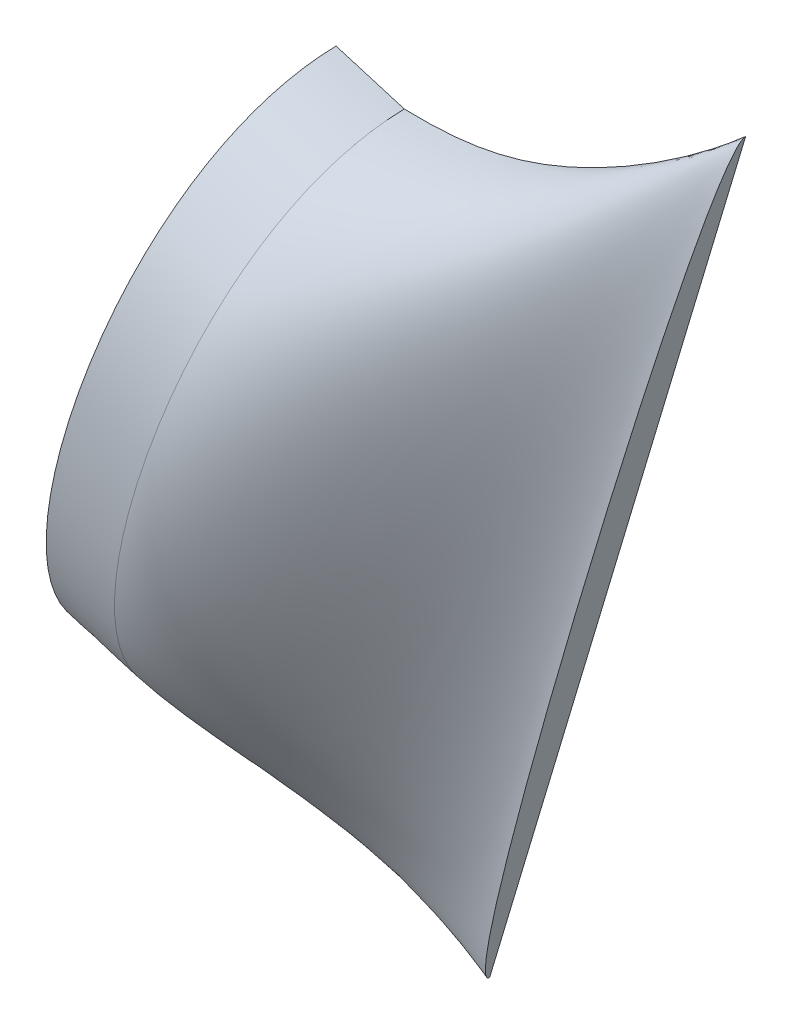
ISO-10303-21;
HEADER;
FILE_DESCRIPTION(('STEP AP214'),'2;1');
FILE_NAME('part.step','',(''),(''),'','','');
FILE_SCHEMA(('AUTOMOTIVE_DESIGN { 1 0 10303 214 1 1 1 1 }'));
ENDSEC;
DATA;
#1=APPLICATION_CONTEXT('core data for automotive mechanical design processes');
#2=APPLICATION_PROTOCOL_DEFINITION('international standard','automotive_design',2000,#1);
#3=PRODUCT_CONTEXT('',#1,'mechanical');
#4=PRODUCT('Part','Part','',(#3));
#5=PRODUCT_RELATED_PRODUCT_CATEGORY('part','',(#4));
#6=PRODUCT_DEFINITION_FORMATION('','',#4);
#7=PRODUCT_DEFINITION_CONTEXT('part definition',#1,'design');
#8=PRODUCT_DEFINITION('design','',#6,#7);
#9=PRODUCT_DEFINITION_SHAPE('','',#8);
#10=(LENGTH_UNIT() NAMED_UNIT(*) SI_UNIT(.MILLI.,.METRE.));
#11=(NAMED_UNIT(*) PLANE_ANGLE_UNIT() SI_UNIT($,.RADIAN.));
#12=(NAMED_UNIT(*) SI_UNIT($,.STERADIAN.) SOLID_ANGLE_UNIT());
#13=UNCERTAINTY_MEASURE_WITH_UNIT(LENGTH_MEASURE(1.E-05),#10,'distance_accuracy_value','');
#14=(GEOMETRIC_REPRESENTATION_CONTEXT(3) GLOBAL_UNCERTAINTY_ASSIGNED_CONTEXT((#13)) GLOBAL_UNIT_ASSIGNED_CONTEXT((#10,
#11,#12)) REPRESENTATION_CONTEXT('',''));
#15=CARTESIAN_POINT('',(0.,0.,0.));
#16=DIRECTION('',(0.,0.,1.));
#17=DIRECTION('',(1.,0.,0.));
#18=AXIS2_PLACEMENT_3D('',#15,#16,#17);
#19=CARTESIAN_POINT('',(-68.8351354727939,20.5796630643947,0.));
#20=DIRECTION('',(0.,0.,1.));
#21=DIRECTION('',(1.,0.,0.));
#22=AXIS2_PLACEMENT_3D('',#19,#20,#21);
#23=PLANE('',#22);
#24=DIRECTION('',(-0.28644268795493,-0.958097378410543,0.));
#25=VECTOR('',#24,1.);
#26=CARTESIAN_POINT('',(-75.1754818984992,-8.30803292728945,0.));
#27=LINE('',#26,#25);
#28=CARTESIAN_POINT('',(-71.680881105449,3.38075508931917,0.));
#29=VERTEX_POINT('',#28);
#30=CARTESIAN_POINT('',(-75.1754818984992,-8.30803292728945,0.));
#31=VERTEX_POINT('',#30);
#32=EDGE_CURVE('E119',#29,#31,#27,.T.);
#33=ORIENTED_EDGE('',*,*,#32,.F.);
#34=DIRECTION('',(-0.958097378410543,0.28644268795493,0.));
#35=VECTOR('',#34,1.);
#36=CARTESIAN_POINT('',(-71.680881105449,3.38075508931917,0.));
#37=LINE('',#36,#35);
#38=CARTESIAN_POINT('',(-76.6629874731838,4.87025706668481,0.));
#39=VERTEX_POINT('',#38);
#40=EDGE_CURVE('E141',#29,#39,#37,.T.);
#41=ORIENTED_EDGE('',*,*,#40,.T.);
#42=DIRECTION('',(0.28644268795493,0.958097378410543,0.));
#43=VECTOR('',#42,1.);
#44=CARTESIAN_POINT('',(-71.7094276080255,21.4389911282595,0.));
#45=LINE('',#44,#43);
#46=CARTESIAN_POINT('',(-74.8260320558074,11.0145304018182,1.41892161006732E-13));
#47=VERTEX_POINT('',#46);
#48=EDGE_CURVE('E206',#39,#47,#45,.T.);
#49=ORIENTED_EDGE('',*,*,#48,.T.);
#50=DIRECTION('',(-0.958097378410543,0.28644268795493,0.));
#51=VECTOR('',#50,1.);
#52=CARTESIAN_POINT('',(-71.9517399205758,10.1552023379534,1.43136294104055E-13));
#53=LINE('',#52,#51);
#54=CARTESIAN_POINT('',(-71.9517399205758,10.1552023379534,0.));
#55=VERTEX_POINT('',#54);
#56=EDGE_CURVE('E11',#55,#47,#53,.T.);
#57=ORIENTED_EDGE('',*,*,#56,.F.);
#58=CARTESIAN_POINT('',(-71.9517399205758,10.1552023379534,0.));
#59=CARTESIAN_POINT('',(-69.5938616061763,10.0813238258005,0.));
#60=CARTESIAN_POINT('',(-65.4570985045668,10.7673698634453,0.));
#61=CARTESIAN_POINT('',(-60.011062756017,14.2052009776582,0.));
#62=CARTESIAN_POINT('',(-57.5775416453369,16.3410180657399,0.));
#63=B_SPLINE_CURVE_WITH_KNOTS('',3,(#58,#59,#60,#61,#62),.UNSPECIFIED.,.F.,.F.,(4,1,4),(0.,
0.464218351567374,1.),.UNSPECIFIED.);
#64=CARTESIAN_POINT('',(-57.5775416453369,16.3410180657399,0.));
#65=VERTEX_POINT('',#64);
#66=EDGE_CURVE('E143',#65,#55,#63,.F.);
#67=ORIENTED_EDGE('',*,*,#66,.F.);
#68=DIRECTION('',(0.286442687954896,0.958097378410553,0.));
#69=VECTOR('',#68,1.);
#70=CARTESIAN_POINT('',(-68.3594778518222,-19.7225480436874,0.));
#71=LINE('',#70,#69);
#72=CARTESIAN_POINT('',(-68.3594778518222,-19.7225480436874,0.));
#73=VERTEX_POINT('',#72);
#74=EDGE_CURVE('E194',#73,#65,#71,.T.);
#75=ORIENTED_EDGE('',*,*,#74,.F.);
#76=CARTESIAN_POINT('',(-79.1202515483788,-13.822132348922,0.));
#77=CARTESIAN_POINT('',(-77.2430299362491,-14.4970734561594,0.));
#78=CARTESIAN_POINT('',(-73.2538280253343,-16.3282447215019,0.));
#79=CARTESIAN_POINT('',(-70.0691808052114,-18.4306839193362,0.));
#80=CARTESIAN_POINT('',(-68.3594778518222,-19.7225480436874,0.));
#81=B_SPLINE_CURVE_WITH_KNOTS('',3,(#76,#77,#78,#79,#80),.UNSPECIFIED.,.F.,.F.,(4,1,4),(0.,
0.464218351567374,1.),.UNSPECIFIED.);
#82=CARTESIAN_POINT('',(-79.1202515483788,-13.822132348922,0.));
#83=VERTEX_POINT('',#82);
#84=EDGE_CURVE('E148',#83,#73,#81,.T.);
#85=ORIENTED_EDGE('',*,*,#84,.F.);
#86=DIRECTION('',(-0.958097378410543,0.28644268795493,0.));
#87=VECTOR('',#86,1.);
#88=CARTESIAN_POINT('',(-79.1202515483788,-13.822132348922,0.));
#89=LINE('',#88,#87);
#90=CARTESIAN_POINT('',(-81.9945436836104,-12.9628042850572,0.));
#91=VERTEX_POINT('',#90);
#92=EDGE_CURVE('E47',#83,#91,#89,.T.);
#93=ORIENTED_EDGE('',*,*,#92,.T.);
#94=CARTESIAN_POINT('',(-80.157588266234,-6.81853094992381,0.));
#95=VERTEX_POINT('',#94);
#96=EDGE_CURVE('E125',#91,#95,#45,.T.);
#97=ORIENTED_EDGE('',*,*,#96,.T.);
#98=DIRECTION('',(-0.958097378410543,0.28644268795493,0.));
#99=VECTOR('',#98,1.);
#100=CARTESIAN_POINT('',(-75.1754818984992,-8.30803292728945,0.));
#101=LINE('',#100,#99);
#102=EDGE_CURVE('E112',#31,#95,#101,.T.);
#103=ORIENTED_EDGE('',*,*,#102,.F.);
#104=EDGE_LOOP('',(#33,#41,#49,#57,#67,#75,#85,#93,#97,#103));
#105=FACE_BOUND('',#104,.T.);
#106=ADVANCED_FACE('F37',(#105),#23,.F.);
#107=CARTESIAN_POINT('',(-71.9517399205757,10.1552023379534,0.));
#108=CARTESIAN_POINT('',(-72.0475401790211,9.83476833727146,10.4883470019911));
#109=CARTESIAN_POINT('',(-78.9396589990728,-13.2180839464793,10.3872504791321));
#110=CARTESIAN_POINT('',(-79.1202515483788,-13.822132348922,0.));
#111=B_SPLINE_CURVE_WITH_KNOTS('',3,(#107,#108,#109,#110),.UNSPECIFIED.,.F.,.F.,(4,4),(0.,1.),.UNSPECIFIED.);
#112=DIRECTION('',(-0.958097378410543,0.28644268795493,0.));
#113=VECTOR('',#112,1.);
#114=SURFACE_OF_LINEAR_EXTRUSION('',#111,#113);
#115=CARTESIAN_POINT('',(-74.8260320558074,11.0145304018182,0.));
#116=CARTESIAN_POINT('',(-74.9218323142527,10.6940964011362,10.4883470019911));
#117=CARTESIAN_POINT('',(-81.8139511343044,-12.3587558826145,10.3872504791321));
#118=CARTESIAN_POINT('',(-81.9945436836104,-12.9628042850572,0.));
#119=B_SPLINE_CURVE_WITH_KNOTS('',3,(#115,#116,#117,#118),.UNSPECIFIED.,.F.,.F.,(4,4),(0.,1.),.UNSPECIFIED.);
#120=EDGE_CURVE('E75',#47,#91,#119,.T.);
#121=ORIENTED_EDGE('',*,*,#120,.T.);
#122=ORIENTED_EDGE('',*,*,#92,.F.);
#123=CARTESIAN_POINT('',(-71.9517399205758,10.1552023379534,0.));
#124=CARTESIAN_POINT('',(-72.0475401790211,9.83476833727144,10.4883470019911));
#125=CARTESIAN_POINT('',(-78.9396589990728,-13.2180839464794,10.3872504791321));
#126=CARTESIAN_POINT('',(-79.1202515483788,-13.822132348922,0.));
#127=B_SPLINE_CURVE_WITH_KNOTS('',3,(#123,#124,#125,#126),.UNSPECIFIED.,.F.,.F.,(4,4),(0.,1.),.UNSPECIFIED.);
#128=EDGE_CURVE('E64',#55,#83,#127,.T.);
#129=ORIENTED_EDGE('',*,*,#128,.F.);
#130=ORIENTED_EDGE('',*,*,#56,.T.);
#131=EDGE_LOOP('',(#121,#122,#129,#130));
#132=FACE_BOUND('',#131,.T.);
#133=ADVANCED_FACE('F226',(#132),#114,.F.);
#134=CARTESIAN_POINT('',(-71.7094276080255,21.4389911282595,0.));
#135=DIRECTION('',(0.958097378410543,-0.28644268795493,0.));
#136=DIRECTION('',(-0.28644268795493,-0.958097378410543,0.));
#137=AXIS2_PLACEMENT_3D('',#134,#135,#136);
#138=PLANE('',#137);
#139=ORIENTED_EDGE('',*,*,#48,.F.);
#140=DIRECTION('',(0.,0.,-1.));
#141=VECTOR('',#140,1.);
#142=CARTESIAN_POINT('',(-76.6629874731838,4.87025706668481,0.));
#143=LINE('',#142,#141);
#144=CARTESIAN_POINT('',(-76.6629874731838,4.87025706668481,4.09999999999997));
#145=VERTEX_POINT('',#144);
#146=EDGE_CURVE('E131',#145,#39,#143,.T.);
#147=ORIENTED_EDGE('',*,*,#146,.F.);
#148=DIRECTION('',(0.28644268795493,0.958097378410543,0.));
#149=VECTOR('',#148,1.);
#150=CARTESIAN_POINT('',(-76.6629874731838,4.87025706668481,4.09999999999997));
#151=LINE('',#150,#149);
#152=CARTESIAN_POINT('',(-80.157588266234,-6.81853094992381,4.09999999999998));
#153=VERTEX_POINT('',#152);
#154=EDGE_CURVE('E133',#153,#145,#151,.T.);
#155=ORIENTED_EDGE('',*,*,#154,.F.);
#156=DIRECTION('',(0.,0.,1.));
#157=VECTOR('',#156,1.);
#158=CARTESIAN_POINT('',(-80.157588266234,-6.81853094992381,4.09999999999998));
#159=LINE('',#158,#157);
#160=EDGE_CURVE('E55',#95,#153,#159,.T.);
#161=ORIENTED_EDGE('',*,*,#160,.F.);
#162=ORIENTED_EDGE('',*,*,#96,.F.);
#163=ORIENTED_EDGE('',*,*,#120,.F.);
#164=EDGE_LOOP('',(#139,#147,#155,#161,#162,#163));
#165=FACE_BOUND('',#164,.T.);
#166=ADVANCED_FACE('F229',(#165),#138,.F.);
#167=CARTESIAN_POINT('',(-62.9685097485796,-1.69076498897374,1.27791279282259));
#168=DIRECTION('',(-0.958097378410553,0.286442687954896,0.));
#169=DIRECTION('',(0.286442687954896,0.958097378410553,0.));
#170=AXIS2_PLACEMENT_3D('',#167,#168,#169);
#171=PLANE('',#170);
#172=CARTESIAN_POINT('',(-57.5775416453369,16.3410180657399,0.));
#173=CARTESIAN_POINT('',(-57.5775416453369,16.3410180657399,1.70388372376346));
#174=CARTESIAN_POINT('',(-68.3594778518222,-19.7225480436874,1.70388372376348));
#175=CARTESIAN_POINT('',(-68.3594778518222,-19.7225480436874,0.));
#176=B_SPLINE_CURVE_WITH_KNOTS('',3,(#172,#173,#174,#175),.UNSPECIFIED.,.F.,.F.,(4,4),(0.,1.),.UNSPECIFIED.);
#177=EDGE_CURVE('E79',#65,#73,#176,.T.);
#178=ORIENTED_EDGE('',*,*,#177,.T.);
#179=ORIENTED_EDGE('',*,*,#74,.T.);
#180=EDGE_LOOP('',(#178,#179));
#181=FACE_BOUND('',#180,.T.);
#182=ADVANCED_FACE('F174',(#181),#171,.F.);
#183=CARTESIAN_POINT('',(-71.9517399205758,10.1552023379534,0.));
#184=CARTESIAN_POINT('',(-69.5938616061763,10.0813238258005,0.));
#185=CARTESIAN_POINT('',(-65.4570985045668,10.7673698634453,0.));
#186=CARTESIAN_POINT('',(-60.011062756017,14.2052009776582,0.));
#187=CARTESIAN_POINT('',(-57.5775416453369,16.3410180657399,0.));
#188=CARTESIAN_POINT('',(-72.0475401790211,9.83476833727144,10.4883470019911));
#189=CARTESIAN_POINT('',(-69.8498807653782,9.56053562675707,10.4883470019911));
#190=CARTESIAN_POINT('',(-65.4138783339914,10.5729305449382,6.19197021566485));
#191=CARTESIAN_POINT('',(-59.76979003692,15.3477613818025,1.70388372376346));
#192=CARTESIAN_POINT('',(-57.5775416453369,16.3410180657399,1.70388372376346));
#193=CARTESIAN_POINT('',(-78.9396589990728,-13.2180839464794,10.3872504791321));
#194=CARTESIAN_POINT('',(-76.9022184861865,-13.6926708553552,10.3872504791321));
#195=CARTESIAN_POINT('',(-73.3459800759381,-16.2974734173909,6.25031093128427));
#196=CARTESIAN_POINT('',(-70.3104535243084,-19.5732443234805,1.70388372376347));
#197=CARTESIAN_POINT('',(-68.3594778518222,-19.7225480436874,1.70388372376348));
#198=CARTESIAN_POINT('',(-79.1202515483788,-13.822132348922,0.));
#199=CARTESIAN_POINT('',(-77.2430299362491,-14.4970734561594,0.));
#200=CARTESIAN_POINT('',(-73.2538280253343,-16.3282447215019,0.));
#201=CARTESIAN_POINT('',(-70.0691808052114,-18.4306839193362,0.));
#202=CARTESIAN_POINT('',(-68.3594778518222,-19.7225480436874,0.));
#203=B_SPLINE_SURFACE_WITH_KNOTS('',3,3,((#183,#184,#185,#186,#187),(#188,#189,#190,#191,#192),
(#193,#194,#195,#196,#197),(#198,#199,#200,#201,#202)),.UNSPECIFIED.,.F.,.F.,.F.,(4,4),(4,1,4),
(0.,1.),(0.,0.464218351567374,1.),.UNSPECIFIED.);
#204=ORIENTED_EDGE('',*,*,#128,.T.);
#205=ORIENTED_EDGE('',*,*,#84,.T.);
#206=ORIENTED_EDGE('',*,*,#177,.F.);
#207=ORIENTED_EDGE('',*,*,#66,.T.);
#208=EDGE_LOOP('',(#204,#205,#206,#207));
#209=FACE_BOUND('',#208,.T.);
#210=ADVANCED_FACE('F161',(#209),#203,.T.);
#211=CARTESIAN_POINT('',(-71.680881105449,3.38075508931917,0.));
#212=DIRECTION('',(0.28644268795493,0.958097378410543,0.));
#213=DIRECTION('',(0.958097378410543,-0.28644268795493,0.));
#214=AXIS2_PLACEMENT_3D('',#211,#212,#213);
#215=PLANE('',#214);
#216=ORIENTED_EDGE('',*,*,#146,.T.);
#217=ORIENTED_EDGE('',*,*,#40,.F.);
#218=DIRECTION('',(0.,0.,-1.));
#219=VECTOR('',#218,1.);
#220=CARTESIAN_POINT('',(-71.680881105449,3.38075508931917,0.));
#221=LINE('',#220,#219);
#222=CARTESIAN_POINT('',(-71.680881105449,3.38075508931917,4.09999999999998));
#223=VERTEX_POINT('',#222);
#224=EDGE_CURVE('E126',#223,#29,#221,.T.);
#225=ORIENTED_EDGE('',*,*,#224,.F.);
#226=DIRECTION('',(-0.958097378410543,0.28644268795493,0.));
#227=VECTOR('',#226,1.);
#228=CARTESIAN_POINT('',(-71.680881105449,3.38075508931917,4.09999999999998));
#229=LINE('',#228,#227);
#230=EDGE_CURVE('E144',#223,#145,#229,.T.);
#231=ORIENTED_EDGE('',*,*,#230,.T.);
#232=EDGE_LOOP('',(#216,#217,#225,#231));
#233=FACE_BOUND('',#232,.T.);
#234=ADVANCED_FACE('F173',(#233),#215,.F.);
#235=CARTESIAN_POINT('',(-71.680881105449,3.38075508931917,4.09999999999998));
#236=DIRECTION('',(0.,0.,1.));
#237=DIRECTION('',(1.,0.,0.));
#238=AXIS2_PLACEMENT_3D('',#235,#236,#237);
#239=PLANE('',#238);
#240=ORIENTED_EDGE('',*,*,#154,.T.);
#241=ORIENTED_EDGE('',*,*,#230,.F.);
#242=DIRECTION('',(0.28644268795493,0.958097378410543,0.));
#243=VECTOR('',#242,1.);
#244=CARTESIAN_POINT('',(-71.680881105449,3.38075508931917,4.09999999999998));
#245=LINE('',#244,#243);
#246=CARTESIAN_POINT('',(-75.1754818984992,-8.30803292728944,4.09999999999998));
#247=VERTEX_POINT('',#246);
#248=EDGE_CURVE('E118',#247,#223,#245,.T.);
#249=ORIENTED_EDGE('',*,*,#248,.F.);
#250=DIRECTION('',(-0.958097378410543,0.28644268795493,0.));
#251=VECTOR('',#250,1.);
#252=CARTESIAN_POINT('',(-75.1754818984992,-8.30803292728944,4.09999999999998));
#253=LINE('',#252,#251);
#254=EDGE_CURVE('E114',#247,#153,#253,.T.);
#255=ORIENTED_EDGE('',*,*,#254,.T.);
#256=EDGE_LOOP('',(#240,#241,#249,#255));
#257=FACE_BOUND('',#256,.T.);
#258=ADVANCED_FACE('F279',(#257),#239,.F.);
#259=CARTESIAN_POINT('',(-75.1754818984992,-8.30803292728944,4.09999999999998));
#260=DIRECTION('',(-0.28644268795493,-0.958097378410543,0.));
#261=DIRECTION('',(-0.958097378410543,0.28644268795493,0.));
#262=AXIS2_PLACEMENT_3D('',#259,#260,#261);
#263=PLANE('',#262);
#264=ORIENTED_EDGE('',*,*,#160,.T.);
#265=ORIENTED_EDGE('',*,*,#254,.F.);
#266=DIRECTION('',(0.,0.,1.));
#267=VECTOR('',#266,1.);
#268=CARTESIAN_POINT('',(-75.1754818984992,-8.30803292728944,4.09999999999998));
#269=LINE('',#268,#267);
#270=EDGE_CURVE('E109',#31,#247,#269,.T.);
#271=ORIENTED_EDGE('',*,*,#270,.F.);
#272=ORIENTED_EDGE('',*,*,#102,.T.);
#273=EDGE_LOOP('',(#264,#265,#271,#272));
#274=FACE_BOUND('',#273,.T.);
#275=ADVANCED_FACE('F111',(#274),#263,.F.);
#276=CARTESIAN_POINT('',(-66.7273212402907,19.9494891508938,0.));
#277=DIRECTION('',(0.958097378410543,-0.28644268795493,0.));
#278=DIRECTION('',(-0.28644268795493,-0.958097378410543,0.));
#279=AXIS2_PLACEMENT_3D('',#276,#277,#278);
#280=PLANE('',#279);
#281=ORIENTED_EDGE('',*,*,#32,.T.);
#282=ORIENTED_EDGE('',*,*,#270,.T.);
#283=ORIENTED_EDGE('',*,*,#248,.T.);
#284=ORIENTED_EDGE('',*,*,#224,.T.);
#285=EDGE_LOOP('',(#281,#282,#283,#284));
#286=FACE_BOUND('',#285,.T.);
#287=ADVANCED_FACE('F128',(#286),#280,.F.);
#288=CLOSED_SHELL('',(#106,#133,#166,#182,#210,#234,#258,#275,#287));
#289=MANIFOLD_SOLID_BREP('B2',#288);
#290=ADVANCED_BREP_SHAPE_REPRESENTATION('',(#18,#289),#14);
#291=SHAPE_DEFINITION_REPRESENTATION(#9,#290);
ENDSEC;
END-ISO-10303-21;
